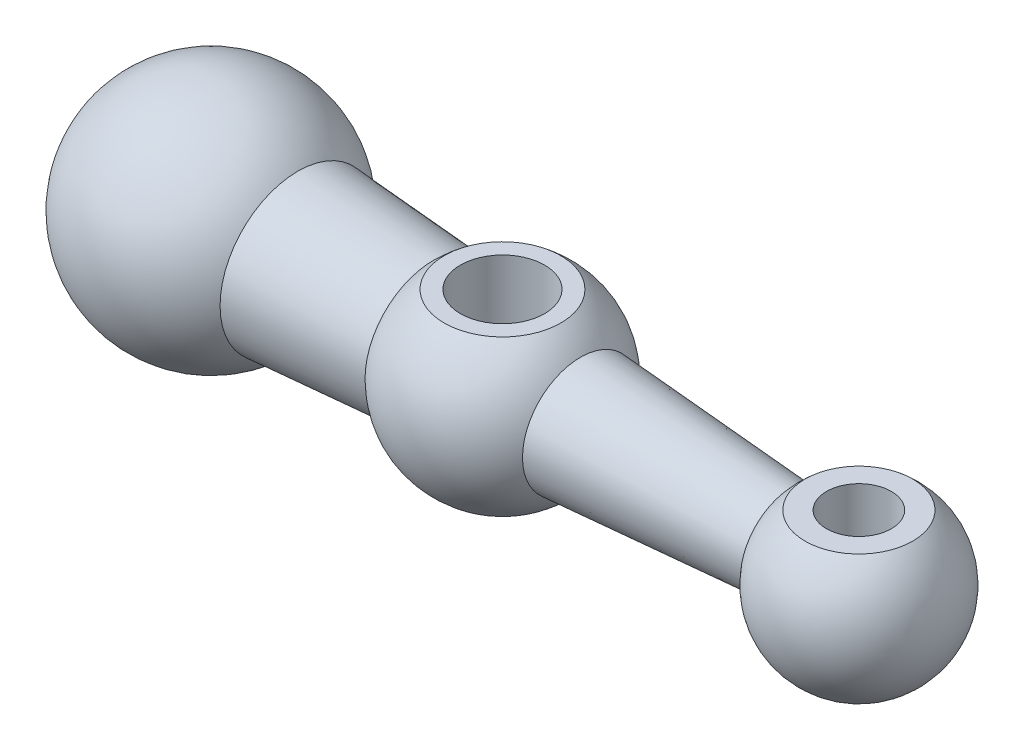
ISO-10303-21;
HEADER;
FILE_DESCRIPTION(('STEP AP214'),'2;1');
FILE_NAME('part.step','',(''),(''),'','','');
FILE_SCHEMA(('AUTOMOTIVE_DESIGN { 1 0 10303 214 1 1 1 1 }'));
ENDSEC;
DATA;
#1=APPLICATION_CONTEXT('core data for automotive mechanical design processes');
#2=APPLICATION_PROTOCOL_DEFINITION('international standard','automotive_design',2000,#1);
#3=PRODUCT_CONTEXT('',#1,'mechanical');
#4=PRODUCT('Part','Part','',(#3));
#5=PRODUCT_RELATED_PRODUCT_CATEGORY('part','',(#4));
#6=PRODUCT_DEFINITION_FORMATION('','',#4);
#7=PRODUCT_DEFINITION_CONTEXT('part definition',#1,'design');
#8=PRODUCT_DEFINITION('design','',#6,#7);
#9=PRODUCT_DEFINITION_SHAPE('','',#8);
#10=(LENGTH_UNIT() NAMED_UNIT(*) SI_UNIT(.MILLI.,.METRE.));
#11=(NAMED_UNIT(*) PLANE_ANGLE_UNIT() SI_UNIT($,.RADIAN.));
#12=(NAMED_UNIT(*) SI_UNIT($,.STERADIAN.) SOLID_ANGLE_UNIT());
#13=UNCERTAINTY_MEASURE_WITH_UNIT(LENGTH_MEASURE(1.E-05),#10,'distance_accuracy_value','');
#14=(GEOMETRIC_REPRESENTATION_CONTEXT(3) GLOBAL_UNCERTAINTY_ASSIGNED_CONTEXT((#13)) GLOBAL_UNIT_ASSIGNED_CONTEXT((#10,
#11,#12)) REPRESENTATION_CONTEXT('',''));
#15=CARTESIAN_POINT('',(0.,0.,0.));
#16=DIRECTION('',(0.,0.,1.));
#17=DIRECTION('',(1.,0.,0.));
#18=AXIS2_PLACEMENT_3D('',#15,#16,#17);
#19=CARTESIAN_POINT('',(45.,0.,0.));
#20=DIRECTION('',(-1.,0.,0.));
#21=DIRECTION('',(0.,1.,0.));
#22=AXIS2_PLACEMENT_3D('',#19,#20,#21);
#23=SPHERICAL_SURFACE('',#22,15.);
#24=CARTESIAN_POINT('',(45.,12.,0.));
#25=DIRECTION('',(0.,1.,0.));
#26=DIRECTION('',(0.,0.,1.));
#27=AXIS2_PLACEMENT_3D('',#24,#25,#26);
#28=CIRCLE('',#27,9.);
#29=CARTESIAN_POINT('',(45.,12.,9.));
#30=VERTEX_POINT('',#29);
#31=EDGE_CURVE('E59',#30,#30,#28,.T.);
#32=ORIENTED_EDGE('',*,*,#31,.F.);
#33=EDGE_LOOP('',(#32));
#34=FACE_BOUND('',#33,.T.);
#35=CARTESIAN_POINT('',(34.3251563556231,0.,0.));
#36=DIRECTION('',(-1.,0.,0.));
#37=DIRECTION('',(0.,0.,1.));
#38=AXIS2_PLACEMENT_3D('',#35,#36,#37);
#39=CIRCLE('',#38,10.537917876322);
#40=CARTESIAN_POINT('',(34.3251563556231,0.,10.537917876322));
#41=VERTEX_POINT('',#40);
#42=EDGE_CURVE('E48',#41,#41,#39,.T.);
#43=ORIENTED_EDGE('',*,*,#42,.F.);
#44=EDGE_LOOP('',(#43));
#45=FACE_BOUND('',#44,.T.);
#46=CARTESIAN_POINT('',(57.0375515083456,0.,0.));
#47=DIRECTION('',(-1.,0.,0.));
#48=DIRECTION('',(0.,0.,1.));
#49=AXIS2_PLACEMENT_3D('',#46,#47,#48);
#50=CIRCLE('',#49,8.94971249169082);
#51=CARTESIAN_POINT('',(57.0375515083456,0.,8.94971249169082));
#52=VERTEX_POINT('',#51);
#53=EDGE_CURVE('E43',#52,#52,#50,.T.);
#54=ORIENTED_EDGE('',*,*,#53,.T.);
#55=EDGE_LOOP('',(#54));
#56=FACE_BOUND('',#55,.T.);
#57=CARTESIAN_POINT('',(45.,-12.,0.));
#58=DIRECTION('',(0.,1.,0.));
#59=DIRECTION('',(0.,0.,1.));
#60=AXIS2_PLACEMENT_3D('',#57,#58,#59);
#61=CIRCLE('',#60,9.);
#62=CARTESIAN_POINT('',(45.,-12.,9.));
#63=VERTEX_POINT('',#62);
#64=EDGE_CURVE('E69',#63,#63,#61,.T.);
#65=ORIENTED_EDGE('',*,*,#64,.T.);
#66=EDGE_LOOP('',(#65));
#67=FACE_BOUND('',#66,.T.);
#68=ADVANCED_FACE('F35',(#34,#45,#56,#67),#23,.T.);
#69=CARTESIAN_POINT('',(45.,-18.,0.));
#70=DIRECTION('',(0.,1.,0.));
#71=DIRECTION('',(0.,0.,1.));
#72=AXIS2_PLACEMENT_3D('',#69,#70,#71);
#73=CYLINDRICAL_SURFACE('',#72,6.5);
#74=CARTESIAN_POINT('',(45.,12.,0.));
#75=DIRECTION('',(0.,1.,0.));
#76=DIRECTION('',(0.,0.,1.));
#77=AXIS2_PLACEMENT_3D('',#74,#75,#76);
#78=CIRCLE('',#77,6.5);
#79=CARTESIAN_POINT('',(45.,12.,6.5));
#80=VERTEX_POINT('',#79);
#81=EDGE_CURVE('E56',#80,#80,#78,.F.);
#82=ORIENTED_EDGE('',*,*,#81,.F.);
#83=EDGE_LOOP('',(#82));
#84=FACE_BOUND('',#83,.T.);
#85=CARTESIAN_POINT('',(45.,-12.,0.));
#86=DIRECTION('',(0.,-1.,0.));
#87=DIRECTION('',(0.,0.,-1.));
#88=AXIS2_PLACEMENT_3D('',#85,#86,#87);
#89=CIRCLE('',#88,6.5);
#90=CARTESIAN_POINT('',(45.,-12.,-6.5));
#91=VERTEX_POINT('',#90);
#92=EDGE_CURVE('E39',#91,#91,#89,.F.);
#93=ORIENTED_EDGE('',*,*,#92,.F.);
#94=EDGE_LOOP('',(#93));
#95=FACE_BOUND('',#94,.T.);
#96=ADVANCED_FACE('F82',(#84,#95),#73,.F.);
#97=CARTESIAN_POINT('',(100.,0.,0.));
#98=DIRECTION('',(-1.,0.,0.));
#99=DIRECTION('',(0.,1.,0.));
#100=AXIS2_PLACEMENT_3D('',#97,#98,#99);
#101=SPHERICAL_SURFACE('',#100,13.);
#102=CARTESIAN_POINT('',(88.8737071987373,0.,0.));
#103=DIRECTION('',(-1.,0.,0.));
#104=DIRECTION('',(0.,0.,1.));
#105=AXIS2_PLACEMENT_3D('',#102,#103,#104);
#106=CIRCLE('',#105,6.72351161972447);
#107=CARTESIAN_POINT('',(88.8737071987373,0.,6.72351161972447));
#108=VERTEX_POINT('',#107);
#109=EDGE_CURVE('E10',#108,#108,#106,.T.);
#110=ORIENTED_EDGE('',*,*,#109,.F.);
#111=EDGE_LOOP('',(#110));
#112=FACE_BOUND('',#111,.T.);
#113=CARTESIAN_POINT('',(100.,10.,0.));
#114=DIRECTION('',(0.,1.,0.));
#115=DIRECTION('',(0.,0.,1.));
#116=AXIS2_PLACEMENT_3D('',#113,#114,#115);
#117=CIRCLE('',#116,8.30662386291807);
#118=CARTESIAN_POINT('',(100.,10.,8.30662386291807));
#119=VERTEX_POINT('',#118);
#120=EDGE_CURVE('E52',#119,#119,#117,.T.);
#121=ORIENTED_EDGE('',*,*,#120,.F.);
#122=EDGE_LOOP('',(#121));
#123=FACE_BOUND('',#122,.T.);
#124=ADVANCED_FACE('F98',(#112,#123),#101,.T.);
#125=CARTESIAN_POINT('',(0.,0.,0.));
#126=DIRECTION('',(-1.,0.,0.));
#127=DIRECTION('',(0.,1.,0.));
#128=AXIS2_PLACEMENT_3D('',#125,#126,#127);
#129=SPHERICAL_SURFACE('',#128,18.);
#130=CARTESIAN_POINT('',(13.4164078649987,0.,0.));
#131=DIRECTION('',(-1.,0.,0.));
#132=DIRECTION('',(0.,0.,1.));
#133=AXIS2_PLACEMENT_3D('',#130,#131,#132);
#134=CIRCLE('',#133,12.);
#135=CARTESIAN_POINT('',(13.4164078649987,0.,12.));
#136=VERTEX_POINT('',#135);
#137=EDGE_CURVE('E54',#136,#136,#134,.T.);
#138=ORIENTED_EDGE('',*,*,#137,.T.);
#139=EDGE_LOOP('',(#138));
#140=FACE_BOUND('',#139,.T.);
#141=ADVANCED_FACE('F37',(#140),#129,.T.);
#142=CARTESIAN_POINT('',(88.8737071987373,0.,0.));
#143=DIRECTION('',(-1.,0.,0.));
#144=DIRECTION('',(0.,0.,1.));
#145=AXIS2_PLACEMENT_3D('',#142,#143,#144);
#146=CONICAL_SURFACE('',#145,6.72351161972447,0.0698131700797734);
#147=ORIENTED_EDGE('',*,*,#53,.F.);
#148=EDGE_LOOP('',(#147));
#149=FACE_BOUND('',#148,.T.);
#150=ORIENTED_EDGE('',*,*,#109,.T.);
#151=EDGE_LOOP('',(#150));
#152=FACE_BOUND('',#151,.T.);
#153=ADVANCED_FACE('F110',(#149,#152),#146,.T.);
#154=CARTESIAN_POINT('',(34.3251563556231,0.,0.));
#155=DIRECTION('',(-1.,0.,0.));
#156=DIRECTION('',(0.,0.,1.));
#157=AXIS2_PLACEMENT_3D('',#154,#155,#156);
#158=CONICAL_SURFACE('',#157,10.537917876322,0.0698131700797733);
#159=ORIENTED_EDGE('',*,*,#137,.F.);
#160=EDGE_LOOP('',(#159));
#161=FACE_BOUND('',#160,.T.);
#162=ORIENTED_EDGE('',*,*,#42,.T.);
#163=EDGE_LOOP('',(#162));
#164=FACE_BOUND('',#163,.T.);
#165=ADVANCED_FACE('F78',(#161,#164),#158,.T.);
#166=CARTESIAN_POINT('',(100.,10.,0.));
#167=DIRECTION('',(0.,1.,0.));
#168=DIRECTION('',(0.,0.,1.));
#169=AXIS2_PLACEMENT_3D('',#166,#167,#168);
#170=PLANE('',#169);
#171=CARTESIAN_POINT('',(100.,10.,0.));
#172=DIRECTION('',(0.,1.,0.));
#173=DIRECTION('',(0.,0.,1.));
#174=AXIS2_PLACEMENT_3D('',#171,#172,#173);
#175=CIRCLE('',#174,5.);
#176=CARTESIAN_POINT('',(100.,10.,5.));
#177=VERTEX_POINT('',#176);
#178=EDGE_CURVE('E58',#177,#177,#175,.T.);
#179=ORIENTED_EDGE('',*,*,#178,.F.);
#180=EDGE_LOOP('',(#179));
#181=FACE_BOUND('',#180,.T.);
#182=ORIENTED_EDGE('',*,*,#120,.T.);
#183=EDGE_LOOP('',(#182));
#184=FACE_BOUND('',#183,.T.);
#185=ADVANCED_FACE('F107',(#181,#184),#170,.T.);
#186=CARTESIAN_POINT('',(100.,0.,0.));
#187=DIRECTION('',(0.,1.,0.));
#188=DIRECTION('',(0.,0.,1.));
#189=AXIS2_PLACEMENT_3D('',#186,#187,#188);
#190=CYLINDRICAL_SURFACE('',#189,5.);
#191=CARTESIAN_POINT('',(100.,0.,0.));
#192=DIRECTION('',(0.,1.,0.));
#193=DIRECTION('',(0.,0.,1.));
#194=AXIS2_PLACEMENT_3D('',#191,#192,#193);
#195=CIRCLE('',#194,5.);
#196=CARTESIAN_POINT('',(100.,0.,5.));
#197=VERTEX_POINT('',#196);
#198=EDGE_CURVE('E55',#197,#197,#195,.T.);
#199=ORIENTED_EDGE('',*,*,#198,.F.);
#200=EDGE_LOOP('',(#199));
#201=FACE_BOUND('',#200,.T.);
#202=ORIENTED_EDGE('',*,*,#178,.T.);
#203=EDGE_LOOP('',(#202));
#204=FACE_BOUND('',#203,.T.);
#205=ADVANCED_FACE('F140',(#201,#204),#190,.F.);
#206=CARTESIAN_POINT('',(100.,0.,0.));
#207=DIRECTION('',(0.,1.,0.));
#208=DIRECTION('',(0.,0.,1.));
#209=AXIS2_PLACEMENT_3D('',#206,#207,#208);
#210=PLANE('',#209);
#211=ORIENTED_EDGE('',*,*,#198,.T.);
#212=EDGE_LOOP('',(#211));
#213=FACE_BOUND('',#212,.T.);
#214=ADVANCED_FACE('F149',(#213),#210,.T.);
#215=CARTESIAN_POINT('',(45.,12.,0.));
#216=DIRECTION('',(0.,1.,0.));
#217=DIRECTION('',(0.,0.,1.));
#218=AXIS2_PLACEMENT_3D('',#215,#216,#217);
#219=PLANE('',#218);
#220=ORIENTED_EDGE('',*,*,#31,.T.);
#221=EDGE_LOOP('',(#220));
#222=FACE_BOUND('',#221,.T.);
#223=ORIENTED_EDGE('',*,*,#81,.T.);
#224=EDGE_LOOP('',(#223));
#225=FACE_BOUND('',#224,.T.);
#226=ADVANCED_FACE('F93',(#222,#225),#219,.T.);
#227=CARTESIAN_POINT('',(45.,-12.,0.));
#228=DIRECTION('',(0.,-1.,0.));
#229=DIRECTION('',(0.,0.,1.));
#230=AXIS2_PLACEMENT_3D('',#227,#228,#229);
#231=PLANE('',#230);
#232=ORIENTED_EDGE('',*,*,#64,.F.);
#233=EDGE_LOOP('',(#232));
#234=FACE_BOUND('',#233,.T.);
#235=ORIENTED_EDGE('',*,*,#92,.T.);
#236=EDGE_LOOP('',(#235));
#237=FACE_BOUND('',#236,.T.);
#238=ADVANCED_FACE('F90',(#234,#237),#231,.T.);
#239=CLOSED_SHELL('',(#68,#96,#124,#141,#153,#165,#185,#205,#214,#226,#238));
#240=MANIFOLD_SOLID_BREP('B2',#239);
#241=ADVANCED_BREP_SHAPE_REPRESENTATION('',(#18,#240),#14);
#242=SHAPE_DEFINITION_REPRESENTATION(#9,#241);
ENDSEC;
END-ISO-10303-21;
